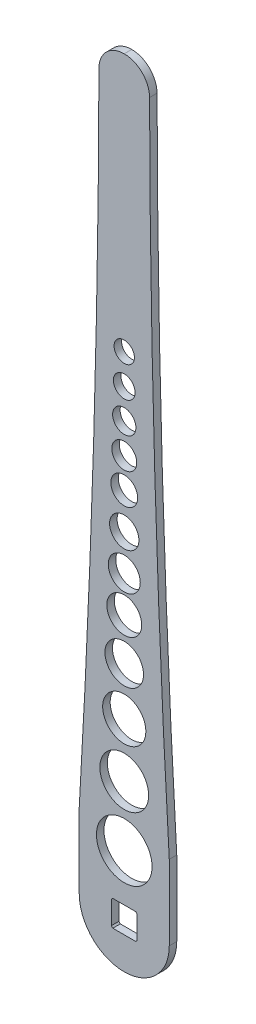
ISO-10303-21;
HEADER;
FILE_DESCRIPTION(('STEP AP214'),'2;1');
FILE_NAME('part.step','',(''),(''),'','','');
FILE_SCHEMA(('AUTOMOTIVE_DESIGN { 1 0 10303 214 1 1 1 1 }'));
ENDSEC;
DATA;
#1=APPLICATION_CONTEXT('core data for automotive mechanical design processes');
#2=APPLICATION_PROTOCOL_DEFINITION('international standard','automotive_design',2000,#1);
#3=PRODUCT_CONTEXT('',#1,'mechanical');
#4=PRODUCT('Part','Part','',(#3));
#5=PRODUCT_RELATED_PRODUCT_CATEGORY('part','',(#4));
#6=PRODUCT_DEFINITION_FORMATION('','',#4);
#7=PRODUCT_DEFINITION_CONTEXT('part definition',#1,'design');
#8=PRODUCT_DEFINITION('design','',#6,#7);
#9=PRODUCT_DEFINITION_SHAPE('','',#8);
#10=(LENGTH_UNIT() NAMED_UNIT(*) SI_UNIT(.MILLI.,.METRE.));
#11=(NAMED_UNIT(*) PLANE_ANGLE_UNIT() SI_UNIT($,.RADIAN.));
#12=(NAMED_UNIT(*) SI_UNIT($,.STERADIAN.) SOLID_ANGLE_UNIT());
#13=UNCERTAINTY_MEASURE_WITH_UNIT(LENGTH_MEASURE(1.E-05),#10,'distance_accuracy_value','');
#14=(GEOMETRIC_REPRESENTATION_CONTEXT(3) GLOBAL_UNCERTAINTY_ASSIGNED_CONTEXT((#13)) GLOBAL_UNIT_ASSIGNED_CONTEXT((#10,
#11,#12)) REPRESENTATION_CONTEXT('',''));
#15=CARTESIAN_POINT('',(0.,0.,0.));
#16=DIRECTION('',(0.,0.,1.));
#17=DIRECTION('',(1.,0.,0.));
#18=AXIS2_PLACEMENT_3D('',#15,#16,#17);
#19=CARTESIAN_POINT('',(-8.6,8.6,-5.));
#20=DIRECTION('',(-1.,0.,0.));
#21=DIRECTION('',(0.,-1.,0.));
#22=AXIS2_PLACEMENT_3D('',#19,#20,#21);
#23=PLANE('',#22);
#24=DIRECTION('',(0.,0.,1.));
#25=VECTOR('',#24,1.);
#26=CARTESIAN_POINT('',(-8.6,-7.63478879865055,-49.424357741048));
#27=LINE('',#26,#25);
#28=CARTESIAN_POINT('',(-8.6,-7.63478879865055,0.));
#29=VERTEX_POINT('',#28);
#30=CARTESIAN_POINT('',(-8.6,-7.63478879865055,5.));
#31=VERTEX_POINT('',#30);
#32=EDGE_CURVE('E269',#29,#31,#27,.T.);
#33=ORIENTED_EDGE('',*,*,#32,.F.);
#34=DIRECTION('',(0.,-1.,0.));
#35=VECTOR('',#34,1.);
#36=CARTESIAN_POINT('',(-8.6,0.,0.));
#37=LINE('',#36,#35);
#38=CARTESIAN_POINT('',(-8.6,7.63478879865055,0.));
#39=VERTEX_POINT('',#38);
#40=EDGE_CURVE('E185',#39,#29,#37,.T.);
#41=ORIENTED_EDGE('',*,*,#40,.F.);
#42=DIRECTION('',(0.,0.,1.));
#43=VECTOR('',#42,1.);
#44=CARTESIAN_POINT('',(-8.6,7.63478879865055,-49.424357741048));
#45=LINE('',#44,#43);
#46=CARTESIAN_POINT('',(-8.6,7.63478879865055,5.));
#47=VERTEX_POINT('',#46);
#48=EDGE_CURVE('E267',#47,#39,#45,.F.);
#49=ORIENTED_EDGE('',*,*,#48,.F.);
#50=DIRECTION('',(0.,-1.,0.));
#51=VECTOR('',#50,1.);
#52=CARTESIAN_POINT('',(-8.6,8.6,5.));
#53=LINE('',#52,#51);
#54=EDGE_CURVE('E271',#47,#31,#53,.T.);
#55=ORIENTED_EDGE('',*,*,#54,.T.);
#56=EDGE_LOOP('',(#33,#41,#49,#55));
#57=FACE_BOUND('',#56,.T.);
#58=ADVANCED_FACE('F39',(#57),#23,.F.);
#59=CARTESIAN_POINT('',(8.6,8.6,-5.));
#60=DIRECTION('',(0.,1.,0.));
#61=DIRECTION('',(-1.,0.,0.));
#62=AXIS2_PLACEMENT_3D('',#59,#60,#61);
#63=PLANE('',#62);
#64=DIRECTION('',(0.,0.,1.));
#65=VECTOR('',#64,1.);
#66=CARTESIAN_POINT('',(-7.63478879865056,8.6,-49.424357741048));
#67=LINE('',#66,#65);
#68=CARTESIAN_POINT('',(-7.63478879865056,8.6,0.));
#69=VERTEX_POINT('',#68);
#70=CARTESIAN_POINT('',(-7.63478879865056,8.6,5.));
#71=VERTEX_POINT('',#70);
#72=EDGE_CURVE('E265',#69,#71,#67,.T.);
#73=ORIENTED_EDGE('',*,*,#72,.F.);
#74=DIRECTION('',(-1.,0.,0.));
#75=VECTOR('',#74,1.);
#76=CARTESIAN_POINT('',(0.,8.6,0.));
#77=LINE('',#76,#75);
#78=CARTESIAN_POINT('',(7.63478879865055,8.6,0.));
#79=VERTEX_POINT('',#78);
#80=EDGE_CURVE('E182',#79,#69,#77,.T.);
#81=ORIENTED_EDGE('',*,*,#80,.F.);
#82=DIRECTION('',(0.,0.,1.));
#83=VECTOR('',#82,1.);
#84=CARTESIAN_POINT('',(7.63478879865055,8.6,-49.424357741048));
#85=LINE('',#84,#83);
#86=CARTESIAN_POINT('',(7.63478879865055,8.6,5.));
#87=VERTEX_POINT('',#86);
#88=EDGE_CURVE('E263',#87,#79,#85,.F.);
#89=ORIENTED_EDGE('',*,*,#88,.F.);
#90=DIRECTION('',(-1.,0.,0.));
#91=VECTOR('',#90,1.);
#92=CARTESIAN_POINT('',(8.6,8.6,5.));
#93=LINE('',#92,#91);
#94=EDGE_CURVE('E279',#87,#71,#93,.T.);
#95=ORIENTED_EDGE('',*,*,#94,.T.);
#96=EDGE_LOOP('',(#73,#81,#89,#95));
#97=FACE_BOUND('',#96,.T.);
#98=ADVANCED_FACE('F363',(#97),#63,.F.);
#99=CARTESIAN_POINT('',(8.6,8.6,-5.));
#100=DIRECTION('',(1.,0.,0.));
#101=DIRECTION('',(0.,1.,0.));
#102=AXIS2_PLACEMENT_3D('',#99,#100,#101);
#103=PLANE('',#102);
#104=DIRECTION('',(0.,0.,1.));
#105=VECTOR('',#104,1.);
#106=CARTESIAN_POINT('',(8.6,7.63478879865056,-49.424357741048));
#107=LINE('',#106,#105);
#108=CARTESIAN_POINT('',(8.6,7.63478879865056,0.));
#109=VERTEX_POINT('',#108);
#110=CARTESIAN_POINT('',(8.6,7.63478879865056,5.));
#111=VERTEX_POINT('',#110);
#112=EDGE_CURVE('E167',#109,#111,#107,.T.);
#113=ORIENTED_EDGE('',*,*,#112,.F.);
#114=DIRECTION('',(0.,1.,0.));
#115=VECTOR('',#114,1.);
#116=CARTESIAN_POINT('',(8.6,0.,0.));
#117=LINE('',#116,#115);
#118=CARTESIAN_POINT('',(8.6,-7.63478879865056,0.));
#119=VERTEX_POINT('',#118);
#120=EDGE_CURVE('E174',#119,#109,#117,.T.);
#121=ORIENTED_EDGE('',*,*,#120,.F.);
#122=DIRECTION('',(0.,0.,1.));
#123=VECTOR('',#122,1.);
#124=CARTESIAN_POINT('',(8.6,-7.63478879865056,-49.424357741048));
#125=LINE('',#124,#123);
#126=CARTESIAN_POINT('',(8.6,-7.63478879865056,5.));
#127=VERTEX_POINT('',#126);
#128=EDGE_CURVE('E156',#127,#119,#125,.F.);
#129=ORIENTED_EDGE('',*,*,#128,.F.);
#130=DIRECTION('',(0.,1.,0.));
#131=VECTOR('',#130,1.);
#132=CARTESIAN_POINT('',(8.6,8.6,5.));
#133=LINE('',#132,#131);
#134=EDGE_CURVE('E277',#127,#111,#133,.T.);
#135=ORIENTED_EDGE('',*,*,#134,.T.);
#136=EDGE_LOOP('',(#113,#121,#129,#135));
#137=FACE_BOUND('',#136,.T.);
#138=ADVANCED_FACE('F181',(#137),#103,.F.);
#139=CARTESIAN_POINT('',(8.6,-8.6,-5.));
#140=DIRECTION('',(0.,-1.,0.));
#141=DIRECTION('',(1.,0.,0.));
#142=AXIS2_PLACEMENT_3D('',#139,#140,#141);
#143=PLANE('',#142);
#144=DIRECTION('',(0.,0.,1.));
#145=VECTOR('',#144,1.);
#146=CARTESIAN_POINT('',(7.63478879865056,-8.6,-49.424357741048));
#147=LINE('',#146,#145);
#148=CARTESIAN_POINT('',(7.63478879865056,-8.6,0.));
#149=VERTEX_POINT('',#148);
#150=CARTESIAN_POINT('',(7.63478879865056,-8.6,5.));
#151=VERTEX_POINT('',#150);
#152=EDGE_CURVE('E196',#149,#151,#147,.T.);
#153=ORIENTED_EDGE('',*,*,#152,.F.);
#154=DIRECTION('',(1.,0.,0.));
#155=VECTOR('',#154,1.);
#156=CARTESIAN_POINT('',(0.,-8.6,0.));
#157=LINE('',#156,#155);
#158=CARTESIAN_POINT('',(-7.63478879865055,-8.6,0.));
#159=VERTEX_POINT('',#158);
#160=EDGE_CURVE('E176',#159,#149,#157,.T.);
#161=ORIENTED_EDGE('',*,*,#160,.F.);
#162=DIRECTION('',(0.,0.,1.));
#163=VECTOR('',#162,1.);
#164=CARTESIAN_POINT('',(-7.63478879865055,-8.6,-49.424357741048));
#165=LINE('',#164,#163);
#166=CARTESIAN_POINT('',(-7.63478879865055,-8.6,5.));
#167=VERTEX_POINT('',#166);
#168=EDGE_CURVE('E193',#167,#159,#165,.F.);
#169=ORIENTED_EDGE('',*,*,#168,.F.);
#170=DIRECTION('',(1.,0.,0.));
#171=VECTOR('',#170,1.);
#172=CARTESIAN_POINT('',(8.6,-8.6,5.));
#173=LINE('',#172,#171);
#174=EDGE_CURVE('E274',#167,#151,#173,.T.);
#175=ORIENTED_EDGE('',*,*,#174,.T.);
#176=EDGE_LOOP('',(#153,#161,#169,#175));
#177=FACE_BOUND('',#176,.T.);
#178=ADVANCED_FACE('F373',(#177),#143,.F.);
#179=CARTESIAN_POINT('',(0.,0.,5.));
#180=DIRECTION('',(0.,0.,-1.));
#181=DIRECTION('',(-1.,0.,0.));
#182=AXIS2_PLACEMENT_3D('',#179,#180,#181);
#183=CYLINDRICAL_SURFACE('',#182,30.);
#184=CARTESIAN_POINT('',(0.,0.,0.));
#185=DIRECTION('',(0.,0.,1.));
#186=DIRECTION('',(1.,0.,0.));
#187=AXIS2_PLACEMENT_3D('',#184,#185,#186);
#188=CIRCLE('',#187,30.);
#189=CARTESIAN_POINT('',(-30.,0.,0.));
#190=VERTEX_POINT('',#189);
#191=CARTESIAN_POINT('',(30.,0.,0.));
#192=VERTEX_POINT('',#191);
#193=EDGE_CURVE('E282',#190,#192,#188,.T.);
#194=ORIENTED_EDGE('',*,*,#193,.T.);
#195=DIRECTION('',(0.,0.,-1.));
#196=VECTOR('',#195,1.);
#197=CARTESIAN_POINT('',(30.,0.,5.));
#198=LINE('',#197,#196);
#199=CARTESIAN_POINT('',(30.,0.,5.));
#200=VERTEX_POINT('',#199);
#201=EDGE_CURVE('E187',#200,#192,#198,.T.);
#202=ORIENTED_EDGE('',*,*,#201,.F.);
#203=CARTESIAN_POINT('',(0.,0.,5.));
#204=DIRECTION('',(0.,0.,1.));
#205=DIRECTION('',(1.,0.,0.));
#206=AXIS2_PLACEMENT_3D('',#203,#204,#205);
#207=CIRCLE('',#206,30.);
#208=CARTESIAN_POINT('',(-30.,0.,5.));
#209=VERTEX_POINT('',#208);
#210=EDGE_CURVE('E283',#209,#200,#207,.T.);
#211=ORIENTED_EDGE('',*,*,#210,.F.);
#212=DIRECTION('',(0.,0.,-1.));
#213=VECTOR('',#212,1.);
#214=CARTESIAN_POINT('',(-30.,0.,5.));
#215=LINE('',#214,#213);
#216=EDGE_CURVE('E297',#209,#190,#215,.T.);
#217=ORIENTED_EDGE('',*,*,#216,.T.);
#218=EDGE_LOOP('',(#194,#202,#211,#217));
#219=FACE_BOUND('',#218,.T.);
#220=ADVANCED_FACE('F325',(#219),#183,.T.);
#221=CARTESIAN_POINT('',(30.,0.,5.));
#222=DIRECTION('',(-1.,0.,0.));
#223=DIRECTION('',(0.,0.,1.));
#224=AXIS2_PLACEMENT_3D('',#221,#222,#223);
#225=PLANE('',#224);
#226=DIRECTION('',(0.,1.,0.));
#227=VECTOR('',#226,1.);
#228=CARTESIAN_POINT('',(30.,0.,0.));
#229=LINE('',#228,#227);
#230=CARTESIAN_POINT('',(29.9999999999994,50.0000000000009,0.));
#231=VERTEX_POINT('',#230);
#232=EDGE_CURVE('E300',#192,#231,#229,.T.);
#233=ORIENTED_EDGE('',*,*,#232,.T.);
#234=DIRECTION('',(0.,0.,-1.));
#235=VECTOR('',#234,1.);
#236=CARTESIAN_POINT('',(29.9999999999994,50.0000000000009,5.));
#237=LINE('',#236,#235);
#238=CARTESIAN_POINT('',(29.9999999999994,50.0000000000009,5.));
#239=VERTEX_POINT('',#238);
#240=EDGE_CURVE('E315',#239,#231,#237,.T.);
#241=ORIENTED_EDGE('',*,*,#240,.F.);
#242=DIRECTION('',(0.,1.,0.));
#243=VECTOR('',#242,1.);
#244=CARTESIAN_POINT('',(30.,0.,5.));
#245=LINE('',#244,#243);
#246=EDGE_CURVE('E286',#200,#239,#245,.T.);
#247=ORIENTED_EDGE('',*,*,#246,.F.);
#248=ORIENTED_EDGE('',*,*,#201,.T.);
#249=EDGE_LOOP('',(#233,#241,#247,#248));
#250=FACE_BOUND('',#249,.T.);
#251=ADVANCED_FACE('F320',(#250),#225,.F.);
#252=CARTESIAN_POINT('',(7723.04477186312,500.,5.));
#253=DIRECTION('',(0.,0.,-1.));
#254=DIRECTION('',(-1.,0.,0.));
#255=AXIS2_PLACEMENT_3D('',#252,#253,#254);
#256=CYLINDRICAL_SURFACE('',#255,7706.19477186312);
#257=CARTESIAN_POINT('',(7723.04477186312,500.,0.));
#258=DIRECTION('',(0.,0.,-1.));
#259=DIRECTION('',(-1.,0.,0.));
#260=AXIS2_PLACEMENT_3D('',#257,#258,#259);
#261=CIRCLE('',#260,7706.19477186312);
#262=CARTESIAN_POINT('',(16.8683414306479,483.186763026551,0.));
#263=VERTEX_POINT('',#262);
#264=EDGE_CURVE('E302',#231,#263,#261,.T.);
#265=ORIENTED_EDGE('',*,*,#264,.T.);
#266=DIRECTION('',(0.,0.,-1.));
#267=VECTOR('',#266,1.);
#268=CARTESIAN_POINT('',(16.8683414306461,483.186763026551,5.));
#269=LINE('',#268,#267);
#270=CARTESIAN_POINT('',(16.8683414306479,483.186763026551,5.));
#271=VERTEX_POINT('',#270);
#272=EDGE_CURVE('E64',#263,#271,#269,.F.);
#273=ORIENTED_EDGE('',*,*,#272,.T.);
#274=CARTESIAN_POINT('',(7723.04477186312,500.,5.));
#275=DIRECTION('',(0.,0.,-1.));
#276=DIRECTION('',(-1.,0.,0.));
#277=AXIS2_PLACEMENT_3D('',#274,#275,#276);
#278=CIRCLE('',#277,7706.19477186312);
#279=EDGE_CURVE('E289',#239,#271,#278,.T.);
#280=ORIENTED_EDGE('',*,*,#279,.F.);
#281=ORIENTED_EDGE('',*,*,#240,.T.);
#282=EDGE_LOOP('',(#265,#273,#280,#281));
#283=FACE_BOUND('',#282,.T.);
#284=ADVANCED_FACE('F332',(#283),#256,.F.);
#285=CARTESIAN_POINT('',(-16.8499999999998,500.,5.));
#286=DIRECTION('',(0.,-1.,0.));
#287=DIRECTION('',(0.,0.,-1.));
#288=AXIS2_PLACEMENT_3D('',#285,#286,#287);
#289=PLANE('',#288);
#290=DIRECTION('',(-1.,0.,0.));
#291=VECTOR('',#290,1.);
#292=CARTESIAN_POINT('',(-16.8499999999998,500.,5.));
#293=LINE('',#292,#291);
#294=CARTESIAN_POINT('',(0.0183815351508798,500.,5.));
#295=VERTEX_POINT('',#294);
#296=CARTESIAN_POINT('',(-0.0183815351508798,500.,5.));
#297=VERTEX_POINT('',#296);
#298=EDGE_CURVE('E291',#295,#297,#293,.T.);
#299=ORIENTED_EDGE('',*,*,#298,.F.);
#300=DIRECTION('',(0.,0.,-1.));
#301=VECTOR('',#300,1.);
#302=CARTESIAN_POINT('',(0.0183815351508798,500.,5.));
#303=LINE('',#302,#301);
#304=CARTESIAN_POINT('',(0.0183815351508798,500.,0.));
#305=VERTEX_POINT('',#304);
#306=EDGE_CURVE('E200',#295,#305,#303,.T.);
#307=ORIENTED_EDGE('',*,*,#306,.T.);
#308=DIRECTION('',(-1.,0.,0.));
#309=VECTOR('',#308,1.);
#310=CARTESIAN_POINT('',(-16.8499999999998,500.,0.));
#311=LINE('',#310,#309);
#312=CARTESIAN_POINT('',(-0.0183815351508798,500.,0.));
#313=VERTEX_POINT('',#312);
#314=EDGE_CURVE('E304',#305,#313,#311,.T.);
#315=ORIENTED_EDGE('',*,*,#314,.T.);
#316=DIRECTION('',(0.,0.,-1.));
#317=VECTOR('',#316,1.);
#318=CARTESIAN_POINT('',(-0.0183815351508798,500.,5.));
#319=LINE('',#318,#317);
#320=EDGE_CURVE('E198',#313,#297,#319,.F.);
#321=ORIENTED_EDGE('',*,*,#320,.T.);
#322=EDGE_LOOP('',(#299,#307,#315,#321));
#323=FACE_BOUND('',#322,.T.);
#324=ADVANCED_FACE('F341',(#323),#289,.F.);
#325=CARTESIAN_POINT('',(-7723.04477186312,500.,5.));
#326=DIRECTION('',(0.,0.,-1.));
#327=DIRECTION('',(-1.,0.,0.));
#328=AXIS2_PLACEMENT_3D('',#325,#326,#327);
#329=CYLINDRICAL_SURFACE('',#328,7706.19477186312);
#330=CARTESIAN_POINT('',(-7723.04477186312,500.,5.));
#331=DIRECTION('',(0.,0.,-1.));
#332=DIRECTION('',(1.,0.,0.));
#333=AXIS2_PLACEMENT_3D('',#330,#331,#332);
#334=CIRCLE('',#333,7706.19477186312);
#335=CARTESIAN_POINT('',(-16.8683414306479,483.186763026551,5.));
#336=VERTEX_POINT('',#335);
#337=CARTESIAN_POINT('',(-30.,50.,5.));
#338=VERTEX_POINT('',#337);
#339=EDGE_CURVE('E293',#336,#338,#334,.T.);
#340=ORIENTED_EDGE('',*,*,#339,.F.);
#341=DIRECTION('',(0.,0.,-1.));
#342=VECTOR('',#341,1.);
#343=CARTESIAN_POINT('',(-16.8683414306461,483.186763026551,5.));
#344=LINE('',#343,#342);
#345=CARTESIAN_POINT('',(-16.8683414306479,483.186763026551,0.));
#346=VERTEX_POINT('',#345);
#347=EDGE_CURVE('E11',#336,#346,#344,.T.);
#348=ORIENTED_EDGE('',*,*,#347,.T.);
#349=CARTESIAN_POINT('',(-7723.04477186312,500.,0.));
#350=DIRECTION('',(0.,0.,-1.));
#351=DIRECTION('',(1.,0.,0.));
#352=AXIS2_PLACEMENT_3D('',#349,#350,#351);
#353=CIRCLE('',#352,7706.19477186312);
#354=CARTESIAN_POINT('',(-30.,50.,0.));
#355=VERTEX_POINT('',#354);
#356=EDGE_CURVE('E307',#346,#355,#353,.T.);
#357=ORIENTED_EDGE('',*,*,#356,.T.);
#358=DIRECTION('',(0.,0.,-1.));
#359=VECTOR('',#358,1.);
#360=CARTESIAN_POINT('',(-30.,50.,5.));
#361=LINE('',#360,#359);
#362=EDGE_CURVE('E312',#338,#355,#361,.T.);
#363=ORIENTED_EDGE('',*,*,#362,.F.);
#364=EDGE_LOOP('',(#340,#348,#357,#363));
#365=FACE_BOUND('',#364,.T.);
#366=ADVANCED_FACE('F346',(#365),#329,.F.);
#367=CARTESIAN_POINT('',(-30.,0.,5.));
#368=DIRECTION('',(1.,0.,0.));
#369=DIRECTION('',(0.,0.,-1.));
#370=AXIS2_PLACEMENT_3D('',#367,#368,#369);
#371=PLANE('',#370);
#372=DIRECTION('',(0.,-1.,0.));
#373=VECTOR('',#372,1.);
#374=CARTESIAN_POINT('',(-30.,0.,0.));
#375=LINE('',#374,#373);
#376=EDGE_CURVE('E287',#355,#190,#375,.T.);
#377=ORIENTED_EDGE('',*,*,#376,.T.);
#378=ORIENTED_EDGE('',*,*,#216,.F.);
#379=DIRECTION('',(0.,-1.,0.));
#380=VECTOR('',#379,1.);
#381=CARTESIAN_POINT('',(-30.,0.,5.));
#382=LINE('',#381,#380);
#383=EDGE_CURVE('E295',#338,#209,#382,.T.);
#384=ORIENTED_EDGE('',*,*,#383,.F.);
#385=ORIENTED_EDGE('',*,*,#362,.T.);
#386=EDGE_LOOP('',(#377,#378,#384,#385));
#387=FACE_BOUND('',#386,.T.);
#388=ADVANCED_FACE('F350',(#387),#371,.F.);
#389=CARTESIAN_POINT('',(0.,0.,5.));
#390=DIRECTION('',(0.,0.,1.));
#391=DIRECTION('',(1.,0.,0.));
#392=AXIS2_PLACEMENT_3D('',#389,#390,#391);
#393=PLANE('',#392);
#394=CARTESIAN_POINT('',(0.,116.,5.));
#395=DIRECTION('',(0.,0.,1.));
#396=DIRECTION('',(1.,0.,0.));
#397=AXIS2_PLACEMENT_3D('',#394,#395,#396);
#398=CIRCLE('',#397,14.3906009732042);
#399=CARTESIAN_POINT('',(14.3906009732042,116.,5.));
#400=VERTEX_POINT('',#399);
#401=EDGE_CURVE('E222',#400,#400,#398,.T.);
#402=ORIENTED_EDGE('',*,*,#401,.F.);
#403=EDGE_LOOP('',(#402));
#404=FACE_BOUND('',#403,.T.);
#405=CARTESIAN_POINT('',(0.,148.,5.));
#406=DIRECTION('',(0.,0.,1.));
#407=DIRECTION('',(1.,0.,0.));
#408=AXIS2_PLACEMENT_3D('',#405,#406,#407);
#409=CIRCLE('',#408,12.8675450634663);
#410=CARTESIAN_POINT('',(12.8675450634663,148.,5.));
#411=VERTEX_POINT('',#410);
#412=EDGE_CURVE('E703',#411,#411,#409,.T.);
#413=ORIENTED_EDGE('',*,*,#412,.F.);
#414=EDGE_LOOP('',(#413));
#415=FACE_BOUND('',#414,.T.);
#416=CARTESIAN_POINT('',(0.,176.,5.));
#417=DIRECTION('',(0.,0.,1.));
#418=DIRECTION('',(1.,0.,0.));
#419=AXIS2_PLACEMENT_3D('',#416,#417,#418);
#420=CIRCLE('',#419,11.6432955353352);
#421=CARTESIAN_POINT('',(11.6432955353352,176.,5.));
#422=VERTEX_POINT('',#421);
#423=EDGE_CURVE('E706',#422,#422,#420,.T.);
#424=ORIENTED_EDGE('',*,*,#423,.F.);
#425=EDGE_LOOP('',(#424));
#426=FACE_BOUND('',#425,.T.);
#427=CARTESIAN_POINT('',(0.,200.,5.));
#428=DIRECTION('',(0.,0.,1.));
#429=DIRECTION('',(1.,0.,0.));
#430=AXIS2_PLACEMENT_3D('',#427,#428,#429);
#431=CIRCLE('',#430,10.6745211319605);
#432=CARTESIAN_POINT('',(10.6745211319605,200.,5.));
#433=VERTEX_POINT('',#432);
#434=EDGE_CURVE('E711',#433,#433,#431,.T.);
#435=ORIENTED_EDGE('',*,*,#434,.F.);
#436=EDGE_LOOP('',(#435));
#437=FACE_BOUND('',#436,.T.);
#438=CARTESIAN_POINT('',(0.,224.,5.));
#439=DIRECTION('',(0.,0.,1.));
#440=DIRECTION('',(1.,0.,0.));
#441=AXIS2_PLACEMENT_3D('',#438,#439,#440);
#442=CIRCLE('',#441,9.7801600451275);
#443=CARTESIAN_POINT('',(9.7801600451275,224.,5.));
#444=VERTEX_POINT('',#443);
#445=EDGE_CURVE('E714',#444,#444,#442,.T.);
#446=ORIENTED_EDGE('',*,*,#445,.F.);
#447=EDGE_LOOP('',(#446));
#448=FACE_BOUND('',#447,.T.);
#449=CARTESIAN_POINT('',(0.,248.,5.));
#450=DIRECTION('',(0.,0.,1.));
#451=DIRECTION('',(1.,0.,0.));
#452=AXIS2_PLACEMENT_3D('',#449,#450,#451);
#453=CIRCLE('',#452,8.96023811320923);
#454=CARTESIAN_POINT('',(8.96023811320923,248.,5.));
#455=VERTEX_POINT('',#454);
#456=EDGE_CURVE('E717',#455,#455,#453,.T.);
#457=ORIENTED_EDGE('',*,*,#456,.F.);
#458=EDGE_LOOP('',(#457));
#459=FACE_BOUND('',#458,.T.);
#460=CARTESIAN_POINT('',(0.,268.,5.));
#461=DIRECTION('',(0.,0.,1.));
#462=DIRECTION('',(1.,0.,0.));
#463=AXIS2_PLACEMENT_3D('',#460,#461,#462);
#464=CIRCLE('',#463,8.33385024152378);
#465=CARTESIAN_POINT('',(8.33385024152378,268.,5.));
#466=VERTEX_POINT('',#465);
#467=EDGE_CURVE('E720',#466,#466,#464,.T.);
#468=ORIENTED_EDGE('',*,*,#467,.F.);
#469=EDGE_LOOP('',(#468));
#470=FACE_BOUND('',#469,.T.);
#471=CARTESIAN_POINT('',(0.,288.,5.));
#472=DIRECTION('',(0.,0.,1.));
#473=DIRECTION('',(1.,0.,0.));
#474=AXIS2_PLACEMENT_3D('',#471,#472,#473);
#475=CIRCLE('',#474,7.75918529985731);
#476=CARTESIAN_POINT('',(7.75918529985731,288.,5.));
#477=VERTEX_POINT('',#476);
#478=EDGE_CURVE('E723',#477,#477,#475,.T.);
#479=ORIENTED_EDGE('',*,*,#478,.F.);
#480=EDGE_LOOP('',(#479));
#481=FACE_BOUND('',#480,.T.);
#482=CARTESIAN_POINT('',(0.,308.,5.));
#483=DIRECTION('',(0.,0.,1.));
#484=DIRECTION('',(1.,0.,0.));
#485=AXIS2_PLACEMENT_3D('',#482,#483,#484);
#486=CIRCLE('',#485,7.23625483061951);
#487=CARTESIAN_POINT('',(7.23625483061951,308.,5.));
#488=VERTEX_POINT('',#487);
#489=EDGE_CURVE('E725',#488,#488,#486,.T.);
#490=ORIENTED_EDGE('',*,*,#489,.F.);
#491=EDGE_LOOP('',(#490));
#492=FACE_BOUND('',#491,.T.);
#493=CARTESIAN_POINT('',(0.,328.,5.));
#494=DIRECTION('',(0.,0.,1.));
#495=DIRECTION('',(1.,0.,0.));
#496=AXIS2_PLACEMENT_3D('',#493,#494,#495);
#497=CIRCLE('',#496,6.76506934008713);
#498=CARTESIAN_POINT('',(6.76506934008713,328.,5.));
#499=VERTEX_POINT('',#498);
#500=EDGE_CURVE('E255',#499,#499,#497,.T.);
#501=ORIENTED_EDGE('',*,*,#500,.F.);
#502=EDGE_LOOP('',(#501));
#503=FACE_BOUND('',#502,.T.);
#504=CARTESIAN_POINT('',(0.,80.,5.));
#505=DIRECTION('',(0.,0.,1.));
#506=DIRECTION('',(1.,0.,0.));
#507=AXIS2_PLACEMENT_3D('',#504,#505,#506);
#508=CIRCLE('',#507,16.2619348618112);
#509=CARTESIAN_POINT('',(16.2619348618112,80.,5.));
#510=VERTEX_POINT('',#509);
#511=EDGE_CURVE('E217',#510,#510,#508,.T.);
#512=ORIENTED_EDGE('',*,*,#511,.F.);
#513=EDGE_LOOP('',(#512));
#514=FACE_BOUND('',#513,.T.);
#515=CARTESIAN_POINT('',(0.,40.,5.));
#516=DIRECTION('',(0.,0.,1.));
#517=DIRECTION('',(1.,0.,0.));
#518=AXIS2_PLACEMENT_3D('',#515,#516,#517);
#519=CIRCLE('',#518,18.5371317381859);
#520=CARTESIAN_POINT('',(18.5371317381859,40.,5.));
#521=VERTEX_POINT('',#520);
#522=EDGE_CURVE('E213',#521,#521,#519,.T.);
#523=ORIENTED_EDGE('',*,*,#522,.F.);
#524=EDGE_LOOP('',(#523));
#525=FACE_BOUND('',#524,.T.);
#526=ORIENTED_EDGE('',*,*,#279,.T.);
#527=CARTESIAN_POINT('',(0.0183815351508798,483.15,5.));
#528=DIRECTION('',(0.,0.,1.));
#529=DIRECTION('',(1.,0.,0.));
#530=AXIS2_PLACEMENT_3D('',#527,#528,#529);
#531=CIRCLE('',#530,16.85);
#532=EDGE_CURVE('E48',#271,#295,#531,.T.);
#533=ORIENTED_EDGE('',*,*,#532,.T.);
#534=ORIENTED_EDGE('',*,*,#298,.T.);
#535=CARTESIAN_POINT('',(-0.0183815351508798,483.15,5.));
#536=DIRECTION('',(0.,0.,1.));
#537=DIRECTION('',(1.,0.,0.));
#538=AXIS2_PLACEMENT_3D('',#535,#536,#537);
#539=CIRCLE('',#538,16.85);
#540=EDGE_CURVE('E56',#297,#336,#539,.T.);
#541=ORIENTED_EDGE('',*,*,#540,.T.);
#542=ORIENTED_EDGE('',*,*,#339,.T.);
#543=ORIENTED_EDGE('',*,*,#383,.T.);
#544=ORIENTED_EDGE('',*,*,#210,.T.);
#545=ORIENTED_EDGE('',*,*,#246,.T.);
#546=EDGE_LOOP('',(#526,#533,#534,#541,#542,#543,#544,#545));
#547=FACE_BOUND('',#546,.T.);
#548=ORIENTED_EDGE('',*,*,#134,.F.);
#549=CARTESIAN_POINT('',(0.,0.,5.));
#550=DIRECTION('',(0.,0.,1.));
#551=DIRECTION('',(1.,0.,0.));
#552=AXIS2_PLACEMENT_3D('',#549,#550,#551);
#553=CIRCLE('',#552,11.5);
#554=EDGE_CURVE('E162',#151,#127,#553,.T.);
#555=ORIENTED_EDGE('',*,*,#554,.F.);
#556=ORIENTED_EDGE('',*,*,#174,.F.);
#557=EDGE_CURVE('E430',#31,#167,#553,.T.);
#558=ORIENTED_EDGE('',*,*,#557,.F.);
#559=ORIENTED_EDGE('',*,*,#54,.F.);
#560=EDGE_CURVE('E260',#71,#47,#553,.T.);
#561=ORIENTED_EDGE('',*,*,#560,.F.);
#562=ORIENTED_EDGE('',*,*,#94,.F.);
#563=EDGE_CURVE('E259',#111,#87,#553,.T.);
#564=ORIENTED_EDGE('',*,*,#563,.F.);
#565=EDGE_LOOP('',(#548,#555,#556,#558,#559,#561,#562,#564));
#566=FACE_BOUND('',#565,.T.);
#567=ADVANCED_FACE('F338',(#404,#415,#426,#437,#448,#459,#470,#481,#492,#503,#514,#525,#547,
#566),#393,.T.);
#568=CARTESIAN_POINT('',(0.,0.,0.));
#569=DIRECTION('',(0.,0.,1.));
#570=DIRECTION('',(1.,0.,0.));
#571=AXIS2_PLACEMENT_3D('',#568,#569,#570);
#572=PLANE('',#571);
#573=CARTESIAN_POINT('',(0.,116.,0.));
#574=DIRECTION('',(0.,0.,1.));
#575=DIRECTION('',(1.,0.,0.));
#576=AXIS2_PLACEMENT_3D('',#573,#574,#575);
#577=CIRCLE('',#576,14.3906009732042);
#578=CARTESIAN_POINT('',(14.3906009732042,116.,0.));
#579=VERTEX_POINT('',#578);
#580=EDGE_CURVE('E43',#579,#579,#577,.T.);
#581=ORIENTED_EDGE('',*,*,#580,.T.);
#582=EDGE_LOOP('',(#581));
#583=FACE_BOUND('',#582,.T.);
#584=CARTESIAN_POINT('',(0.,148.,0.));
#585=DIRECTION('',(0.,0.,1.));
#586=DIRECTION('',(1.,0.,0.));
#587=AXIS2_PLACEMENT_3D('',#584,#585,#586);
#588=CIRCLE('',#587,12.8675450634663);
#589=CARTESIAN_POINT('',(12.8675450634663,148.,0.));
#590=VERTEX_POINT('',#589);
#591=EDGE_CURVE('E242',#590,#590,#588,.T.);
#592=ORIENTED_EDGE('',*,*,#591,.T.);
#593=EDGE_LOOP('',(#592));
#594=FACE_BOUND('',#593,.T.);
#595=CARTESIAN_POINT('',(0.,176.,0.));
#596=DIRECTION('',(0.,0.,1.));
#597=DIRECTION('',(1.,0.,0.));
#598=AXIS2_PLACEMENT_3D('',#595,#596,#597);
#599=CIRCLE('',#598,11.6432955353352);
#600=CARTESIAN_POINT('',(11.6432955353352,176.,0.));
#601=VERTEX_POINT('',#600);
#602=EDGE_CURVE('E240',#601,#601,#599,.T.);
#603=ORIENTED_EDGE('',*,*,#602,.T.);
#604=EDGE_LOOP('',(#603));
#605=FACE_BOUND('',#604,.T.);
#606=CARTESIAN_POINT('',(0.,200.,0.));
#607=DIRECTION('',(0.,0.,1.));
#608=DIRECTION('',(1.,0.,0.));
#609=AXIS2_PLACEMENT_3D('',#606,#607,#608);
#610=CIRCLE('',#609,10.6745211319605);
#611=CARTESIAN_POINT('',(10.6745211319605,200.,0.));
#612=VERTEX_POINT('',#611);
#613=EDGE_CURVE('E237',#612,#612,#610,.T.);
#614=ORIENTED_EDGE('',*,*,#613,.T.);
#615=EDGE_LOOP('',(#614));
#616=FACE_BOUND('',#615,.T.);
#617=CARTESIAN_POINT('',(0.,224.,0.));
#618=DIRECTION('',(0.,0.,1.));
#619=DIRECTION('',(1.,0.,0.));
#620=AXIS2_PLACEMENT_3D('',#617,#618,#619);
#621=CIRCLE('',#620,9.7801600451275);
#622=CARTESIAN_POINT('',(9.7801600451275,224.,0.));
#623=VERTEX_POINT('',#622);
#624=EDGE_CURVE('E234',#623,#623,#621,.T.);
#625=ORIENTED_EDGE('',*,*,#624,.T.);
#626=EDGE_LOOP('',(#625));
#627=FACE_BOUND('',#626,.T.);
#628=CARTESIAN_POINT('',(0.,248.,0.));
#629=DIRECTION('',(0.,0.,1.));
#630=DIRECTION('',(1.,0.,0.));
#631=AXIS2_PLACEMENT_3D('',#628,#629,#630);
#632=CIRCLE('',#631,8.96023811320923);
#633=CARTESIAN_POINT('',(8.96023811320923,248.,0.));
#634=VERTEX_POINT('',#633);
#635=EDGE_CURVE('E231',#634,#634,#632,.T.);
#636=ORIENTED_EDGE('',*,*,#635,.T.);
#637=EDGE_LOOP('',(#636));
#638=FACE_BOUND('',#637,.T.);
#639=CARTESIAN_POINT('',(0.,268.,0.));
#640=DIRECTION('',(0.,0.,1.));
#641=DIRECTION('',(1.,0.,0.));
#642=AXIS2_PLACEMENT_3D('',#639,#640,#641);
#643=CIRCLE('',#642,8.33385024152378);
#644=CARTESIAN_POINT('',(8.33385024152378,268.,0.));
#645=VERTEX_POINT('',#644);
#646=EDGE_CURVE('E228',#645,#645,#643,.T.);
#647=ORIENTED_EDGE('',*,*,#646,.T.);
#648=EDGE_LOOP('',(#647));
#649=FACE_BOUND('',#648,.T.);
#650=CARTESIAN_POINT('',(0.,288.,0.));
#651=DIRECTION('',(0.,0.,1.));
#652=DIRECTION('',(1.,0.,0.));
#653=AXIS2_PLACEMENT_3D('',#650,#651,#652);
#654=CIRCLE('',#653,7.75918529985731);
#655=CARTESIAN_POINT('',(7.75918529985731,288.,0.));
#656=VERTEX_POINT('',#655);
#657=EDGE_CURVE('E225',#656,#656,#654,.T.);
#658=ORIENTED_EDGE('',*,*,#657,.T.);
#659=EDGE_LOOP('',(#658));
#660=FACE_BOUND('',#659,.T.);
#661=CARTESIAN_POINT('',(0.,308.,0.));
#662=DIRECTION('',(0.,0.,1.));
#663=DIRECTION('',(1.,0.,0.));
#664=AXIS2_PLACEMENT_3D('',#661,#662,#663);
#665=CIRCLE('',#664,7.23625483061951);
#666=CARTESIAN_POINT('',(7.23625483061951,308.,0.));
#667=VERTEX_POINT('',#666);
#668=EDGE_CURVE('E221',#667,#667,#665,.T.);
#669=ORIENTED_EDGE('',*,*,#668,.T.);
#670=EDGE_LOOP('',(#669));
#671=FACE_BOUND('',#670,.T.);
#672=CARTESIAN_POINT('',(0.,328.,0.));
#673=DIRECTION('',(0.,0.,1.));
#674=DIRECTION('',(1.,0.,0.));
#675=AXIS2_PLACEMENT_3D('',#672,#673,#674);
#676=CIRCLE('',#675,6.76506934008713);
#677=CARTESIAN_POINT('',(6.76506934008713,328.,0.));
#678=VERTEX_POINT('',#677);
#679=EDGE_CURVE('E218',#678,#678,#676,.T.);
#680=ORIENTED_EDGE('',*,*,#679,.T.);
#681=EDGE_LOOP('',(#680));
#682=FACE_BOUND('',#681,.T.);
#683=CARTESIAN_POINT('',(0.,80.,0.));
#684=DIRECTION('',(0.,0.,1.));
#685=DIRECTION('',(1.,0.,0.));
#686=AXIS2_PLACEMENT_3D('',#683,#684,#685);
#687=CIRCLE('',#686,16.2619348618112);
#688=CARTESIAN_POINT('',(16.2619348618112,80.,0.));
#689=VERTEX_POINT('',#688);
#690=EDGE_CURVE('E214',#689,#689,#687,.T.);
#691=ORIENTED_EDGE('',*,*,#690,.T.);
#692=EDGE_LOOP('',(#691));
#693=FACE_BOUND('',#692,.T.);
#694=CARTESIAN_POINT('',(0.,40.,0.));
#695=DIRECTION('',(0.,0.,1.));
#696=DIRECTION('',(1.,0.,0.));
#697=AXIS2_PLACEMENT_3D('',#694,#695,#696);
#698=CIRCLE('',#697,18.5371317381859);
#699=CARTESIAN_POINT('',(18.5371317381859,40.,0.));
#700=VERTEX_POINT('',#699);
#701=EDGE_CURVE('E210',#700,#700,#698,.T.);
#702=ORIENTED_EDGE('',*,*,#701,.T.);
#703=EDGE_LOOP('',(#702));
#704=FACE_BOUND('',#703,.T.);
#705=ORIENTED_EDGE('',*,*,#314,.F.);
#706=CARTESIAN_POINT('',(0.0183815351508798,483.15,0.));
#707=DIRECTION('',(0.,0.,1.));
#708=DIRECTION('',(1.,0.,0.));
#709=AXIS2_PLACEMENT_3D('',#706,#707,#708);
#710=CIRCLE('',#709,16.85);
#711=EDGE_CURVE('E205',#305,#263,#710,.F.);
#712=ORIENTED_EDGE('',*,*,#711,.T.);
#713=ORIENTED_EDGE('',*,*,#264,.F.);
#714=ORIENTED_EDGE('',*,*,#232,.F.);
#715=ORIENTED_EDGE('',*,*,#193,.F.);
#716=ORIENTED_EDGE('',*,*,#376,.F.);
#717=ORIENTED_EDGE('',*,*,#356,.F.);
#718=CARTESIAN_POINT('',(-0.0183815351508798,483.15,0.));
#719=DIRECTION('',(0.,0.,1.));
#720=DIRECTION('',(1.,0.,0.));
#721=AXIS2_PLACEMENT_3D('',#718,#719,#720);
#722=CIRCLE('',#721,16.85);
#723=EDGE_CURVE('E203',#346,#313,#722,.F.);
#724=ORIENTED_EDGE('',*,*,#723,.T.);
#725=EDGE_LOOP('',(#705,#712,#713,#714,#715,#716,#717,#724));
#726=FACE_BOUND('',#725,.T.);
#727=ORIENTED_EDGE('',*,*,#120,.T.);
#728=CARTESIAN_POINT('',(0.,0.,0.));
#729=DIRECTION('',(0.,0.,1.));
#730=DIRECTION('',(1.,0.,0.));
#731=AXIS2_PLACEMENT_3D('',#728,#729,#730);
#732=CIRCLE('',#731,11.5);
#733=EDGE_CURVE('E179',#79,#109,#732,.F.);
#734=ORIENTED_EDGE('',*,*,#733,.F.);
#735=ORIENTED_EDGE('',*,*,#80,.T.);
#736=EDGE_CURVE('E439',#39,#69,#732,.F.);
#737=ORIENTED_EDGE('',*,*,#736,.F.);
#738=ORIENTED_EDGE('',*,*,#40,.T.);
#739=EDGE_CURVE('E177',#159,#29,#732,.F.);
#740=ORIENTED_EDGE('',*,*,#739,.F.);
#741=ORIENTED_EDGE('',*,*,#160,.T.);
#742=EDGE_CURVE('E159',#119,#149,#732,.F.);
#743=ORIENTED_EDGE('',*,*,#742,.F.);
#744=EDGE_LOOP('',(#727,#734,#735,#737,#738,#740,#741,#743));
#745=FACE_BOUND('',#744,.T.);
#746=ADVANCED_FACE('F172',(#583,#594,#605,#616,#627,#638,#649,#660,#671,#682,#693,#704,#726,
#745),#572,.F.);
#747=CARTESIAN_POINT('',(0.,0.,-49.424357741048));
#748=DIRECTION('',(0.,0.,1.));
#749=DIRECTION('',(1.,0.,0.));
#750=AXIS2_PLACEMENT_3D('',#747,#748,#749);
#751=CYLINDRICAL_SURFACE('',#750,11.5);
#752=ORIENTED_EDGE('',*,*,#739,.T.);
#753=ORIENTED_EDGE('',*,*,#32,.T.);
#754=ORIENTED_EDGE('',*,*,#557,.T.);
#755=ORIENTED_EDGE('',*,*,#168,.T.);
#756=EDGE_LOOP('',(#752,#753,#754,#755));
#757=FACE_BOUND('',#756,.T.);
#758=ADVANCED_FACE('F376',(#757),#751,.F.);
#759=ORIENTED_EDGE('',*,*,#554,.T.);
#760=ORIENTED_EDGE('',*,*,#128,.T.);
#761=ORIENTED_EDGE('',*,*,#742,.T.);
#762=ORIENTED_EDGE('',*,*,#152,.T.);
#763=EDGE_LOOP('',(#759,#760,#761,#762));
#764=FACE_BOUND('',#763,.T.);
#765=ADVANCED_FACE('F158',(#764),#751,.F.);
#766=ORIENTED_EDGE('',*,*,#563,.T.);
#767=ORIENTED_EDGE('',*,*,#88,.T.);
#768=ORIENTED_EDGE('',*,*,#733,.T.);
#769=ORIENTED_EDGE('',*,*,#112,.T.);
#770=EDGE_LOOP('',(#766,#767,#768,#769));
#771=FACE_BOUND('',#770,.T.);
#772=ADVANCED_FACE('F442',(#771),#751,.F.);
#773=ORIENTED_EDGE('',*,*,#560,.T.);
#774=ORIENTED_EDGE('',*,*,#48,.T.);
#775=ORIENTED_EDGE('',*,*,#736,.T.);
#776=ORIENTED_EDGE('',*,*,#72,.T.);
#777=EDGE_LOOP('',(#773,#774,#775,#776));
#778=FACE_BOUND('',#777,.T.);
#779=ADVANCED_FACE('F383',(#778),#751,.F.);
#780=CARTESIAN_POINT('',(0.0183815351508798,483.15,5.));
#781=DIRECTION('',(0.,0.,-1.));
#782=DIRECTION('',(-1.,0.,0.));
#783=AXIS2_PLACEMENT_3D('',#780,#781,#782);
#784=CYLINDRICAL_SURFACE('',#783,16.85);
#785=ORIENTED_EDGE('',*,*,#532,.F.);
#786=ORIENTED_EDGE('',*,*,#272,.F.);
#787=ORIENTED_EDGE('',*,*,#711,.F.);
#788=ORIENTED_EDGE('',*,*,#306,.F.);
#789=EDGE_LOOP('',(#785,#786,#787,#788));
#790=FACE_BOUND('',#789,.T.);
#791=ADVANCED_FACE('F335',(#790),#784,.T.);
#792=CARTESIAN_POINT('',(-0.0183815351508798,483.15,5.));
#793=DIRECTION('',(0.,0.,-1.));
#794=DIRECTION('',(-1.,0.,0.));
#795=AXIS2_PLACEMENT_3D('',#792,#793,#794);
#796=CYLINDRICAL_SURFACE('',#795,16.85);
#797=ORIENTED_EDGE('',*,*,#540,.F.);
#798=ORIENTED_EDGE('',*,*,#320,.F.);
#799=ORIENTED_EDGE('',*,*,#723,.F.);
#800=ORIENTED_EDGE('',*,*,#347,.F.);
#801=EDGE_LOOP('',(#797,#798,#799,#800));
#802=FACE_BOUND('',#801,.T.);
#803=ADVANCED_FACE('F41',(#802),#796,.T.);
#804=CARTESIAN_POINT('',(0.,40.,-5.));
#805=DIRECTION('',(0.,0.,1.));
#806=DIRECTION('',(1.,0.,0.));
#807=AXIS2_PLACEMENT_3D('',#804,#805,#806);
#808=CYLINDRICAL_SURFACE('',#807,18.5371317381859);
#809=ORIENTED_EDGE('',*,*,#522,.T.);
#810=EDGE_LOOP('',(#809));
#811=FACE_BOUND('',#810,.T.);
#812=ORIENTED_EDGE('',*,*,#701,.F.);
#813=EDGE_LOOP('',(#812));
#814=FACE_BOUND('',#813,.T.);
#815=ADVANCED_FACE('F405',(#811,#814),#808,.F.);
#816=CARTESIAN_POINT('',(0.,80.,-5.));
#817=DIRECTION('',(0.,0.,1.));
#818=DIRECTION('',(1.,0.,0.));
#819=AXIS2_PLACEMENT_3D('',#816,#817,#818);
#820=CYLINDRICAL_SURFACE('',#819,16.2619348618112);
#821=ORIENTED_EDGE('',*,*,#511,.T.);
#822=EDGE_LOOP('',(#821));
#823=FACE_BOUND('',#822,.T.);
#824=ORIENTED_EDGE('',*,*,#690,.F.);
#825=EDGE_LOOP('',(#824));
#826=FACE_BOUND('',#825,.T.);
#827=ADVANCED_FACE('F407',(#823,#826),#820,.F.);
#828=CARTESIAN_POINT('',(0.,328.,-5.));
#829=DIRECTION('',(0.,0.,1.));
#830=DIRECTION('',(1.,0.,0.));
#831=AXIS2_PLACEMENT_3D('',#828,#829,#830);
#832=CYLINDRICAL_SURFACE('',#831,6.76506934008713);
#833=ORIENTED_EDGE('',*,*,#500,.T.);
#834=EDGE_LOOP('',(#833));
#835=FACE_BOUND('',#834,.T.);
#836=ORIENTED_EDGE('',*,*,#679,.F.);
#837=EDGE_LOOP('',(#836));
#838=FACE_BOUND('',#837,.T.);
#839=ADVANCED_FACE('F414',(#835,#838),#832,.F.);
#840=CARTESIAN_POINT('',(0.,308.,-5.));
#841=DIRECTION('',(0.,0.,1.));
#842=DIRECTION('',(1.,0.,0.));
#843=AXIS2_PLACEMENT_3D('',#840,#841,#842);
#844=CYLINDRICAL_SURFACE('',#843,7.23625483061951);
#845=ORIENTED_EDGE('',*,*,#489,.T.);
#846=EDGE_LOOP('',(#845));
#847=FACE_BOUND('',#846,.T.);
#848=ORIENTED_EDGE('',*,*,#668,.F.);
#849=EDGE_LOOP('',(#848));
#850=FACE_BOUND('',#849,.T.);
#851=ADVANCED_FACE('F607',(#847,#850),#844,.F.);
#852=CARTESIAN_POINT('',(0.,288.,-5.));
#853=DIRECTION('',(0.,0.,1.));
#854=DIRECTION('',(1.,0.,0.));
#855=AXIS2_PLACEMENT_3D('',#852,#853,#854);
#856=CYLINDRICAL_SURFACE('',#855,7.75918529985731);
#857=ORIENTED_EDGE('',*,*,#478,.T.);
#858=EDGE_LOOP('',(#857));
#859=FACE_BOUND('',#858,.T.);
#860=ORIENTED_EDGE('',*,*,#657,.F.);
#861=EDGE_LOOP('',(#860));
#862=FACE_BOUND('',#861,.T.);
#863=ADVANCED_FACE('F615',(#859,#862),#856,.F.);
#864=CARTESIAN_POINT('',(0.,268.,-5.));
#865=DIRECTION('',(0.,0.,1.));
#866=DIRECTION('',(1.,0.,0.));
#867=AXIS2_PLACEMENT_3D('',#864,#865,#866);
#868=CYLINDRICAL_SURFACE('',#867,8.33385024152378);
#869=ORIENTED_EDGE('',*,*,#467,.T.);
#870=EDGE_LOOP('',(#869));
#871=FACE_BOUND('',#870,.T.);
#872=ORIENTED_EDGE('',*,*,#646,.F.);
#873=EDGE_LOOP('',(#872));
#874=FACE_BOUND('',#873,.T.);
#875=ADVANCED_FACE('F624',(#871,#874),#868,.F.);
#876=CARTESIAN_POINT('',(0.,248.,-5.));
#877=DIRECTION('',(0.,0.,1.));
#878=DIRECTION('',(1.,0.,0.));
#879=AXIS2_PLACEMENT_3D('',#876,#877,#878);
#880=CYLINDRICAL_SURFACE('',#879,8.96023811320923);
#881=ORIENTED_EDGE('',*,*,#456,.T.);
#882=EDGE_LOOP('',(#881));
#883=FACE_BOUND('',#882,.T.);
#884=ORIENTED_EDGE('',*,*,#635,.F.);
#885=EDGE_LOOP('',(#884));
#886=FACE_BOUND('',#885,.T.);
#887=ADVANCED_FACE('F633',(#883,#886),#880,.F.);
#888=CARTESIAN_POINT('',(0.,224.,-5.));
#889=DIRECTION('',(0.,0.,1.));
#890=DIRECTION('',(1.,0.,0.));
#891=AXIS2_PLACEMENT_3D('',#888,#889,#890);
#892=CYLINDRICAL_SURFACE('',#891,9.7801600451275);
#893=ORIENTED_EDGE('',*,*,#445,.T.);
#894=EDGE_LOOP('',(#893));
#895=FACE_BOUND('',#894,.T.);
#896=ORIENTED_EDGE('',*,*,#624,.F.);
#897=EDGE_LOOP('',(#896));
#898=FACE_BOUND('',#897,.T.);
#899=ADVANCED_FACE('F642',(#895,#898),#892,.F.);
#900=CARTESIAN_POINT('',(0.,200.,-5.));
#901=DIRECTION('',(0.,0.,1.));
#902=DIRECTION('',(1.,0.,0.));
#903=AXIS2_PLACEMENT_3D('',#900,#901,#902);
#904=CYLINDRICAL_SURFACE('',#903,10.6745211319605);
#905=ORIENTED_EDGE('',*,*,#434,.T.);
#906=EDGE_LOOP('',(#905));
#907=FACE_BOUND('',#906,.T.);
#908=ORIENTED_EDGE('',*,*,#613,.F.);
#909=EDGE_LOOP('',(#908));
#910=FACE_BOUND('',#909,.T.);
#911=ADVANCED_FACE('F651',(#907,#910),#904,.F.);
#912=CARTESIAN_POINT('',(0.,176.,-5.));
#913=DIRECTION('',(0.,0.,1.));
#914=DIRECTION('',(1.,0.,0.));
#915=AXIS2_PLACEMENT_3D('',#912,#913,#914);
#916=CYLINDRICAL_SURFACE('',#915,11.6432955353352);
#917=ORIENTED_EDGE('',*,*,#423,.T.);
#918=EDGE_LOOP('',(#917));
#919=FACE_BOUND('',#918,.T.);
#920=ORIENTED_EDGE('',*,*,#602,.F.);
#921=EDGE_LOOP('',(#920));
#922=FACE_BOUND('',#921,.T.);
#923=ADVANCED_FACE('F660',(#919,#922),#916,.F.);
#924=CARTESIAN_POINT('',(0.,148.,-5.));
#925=DIRECTION('',(0.,0.,1.));
#926=DIRECTION('',(1.,0.,0.));
#927=AXIS2_PLACEMENT_3D('',#924,#925,#926);
#928=CYLINDRICAL_SURFACE('',#927,12.8675450634663);
#929=ORIENTED_EDGE('',*,*,#412,.T.);
#930=EDGE_LOOP('',(#929));
#931=FACE_BOUND('',#930,.T.);
#932=ORIENTED_EDGE('',*,*,#591,.F.);
#933=EDGE_LOOP('',(#932));
#934=FACE_BOUND('',#933,.T.);
#935=ADVANCED_FACE('F669',(#931,#934),#928,.F.);
#936=CARTESIAN_POINT('',(0.,116.,-5.));
#937=DIRECTION('',(0.,0.,1.));
#938=DIRECTION('',(1.,0.,0.));
#939=AXIS2_PLACEMENT_3D('',#936,#937,#938);
#940=CYLINDRICAL_SURFACE('',#939,14.3906009732042);
#941=ORIENTED_EDGE('',*,*,#401,.T.);
#942=EDGE_LOOP('',(#941));
#943=FACE_BOUND('',#942,.T.);
#944=ORIENTED_EDGE('',*,*,#580,.F.);
#945=EDGE_LOOP('',(#944));
#946=FACE_BOUND('',#945,.T.);
#947=ADVANCED_FACE('F678',(#943,#946),#940,.F.);
#948=CLOSED_SHELL('',(#58,#98,#138,#178,#220,#251,#284,#324,#366,#388,#567,#746,#758,#765,#772,
#779,#791,#803,#815,#827,#839,#851,#863,#875,#887,#899,#911,#923,#935,#947));
#949=MANIFOLD_SOLID_BREP('B2',#948);
#950=ADVANCED_BREP_SHAPE_REPRESENTATION('',(#18,#949),#14);
#951=SHAPE_DEFINITION_REPRESENTATION(#9,#950);
ENDSEC;
END-ISO-10303-21;
